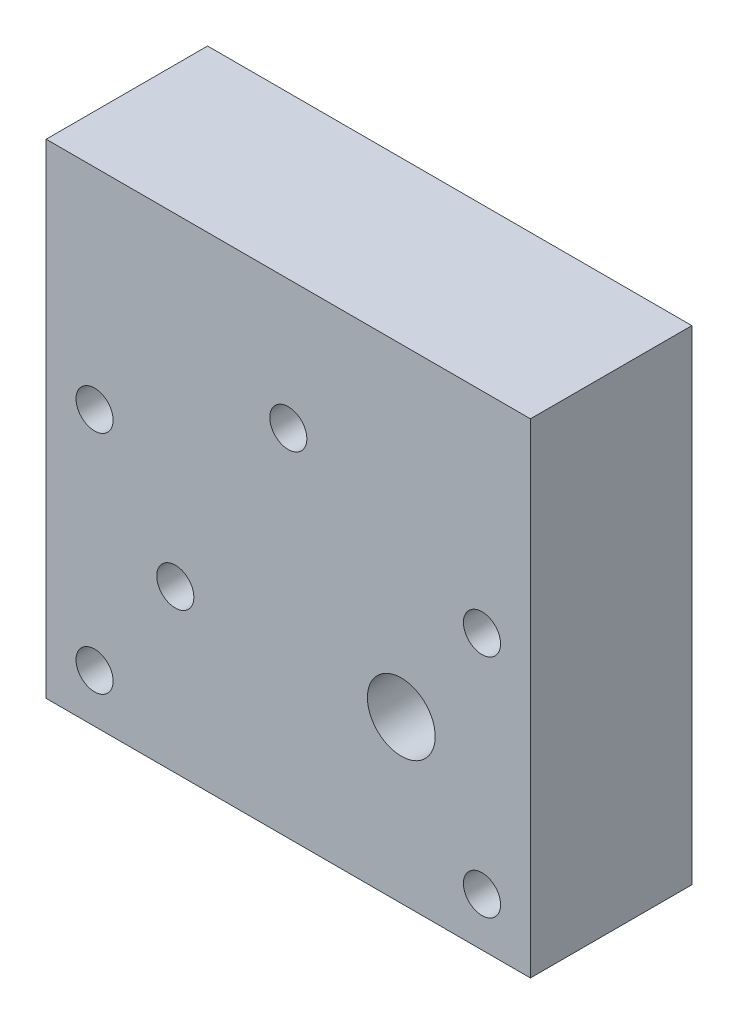
ISO-10303-21;
HEADER;
FILE_DESCRIPTION(('STEP AP214'),'2;1');
FILE_NAME('part.step','',(''),(''),'','','');
FILE_SCHEMA(('AUTOMOTIVE_DESIGN { 1 0 10303 214 1 1 1 1 }'));
ENDSEC;
DATA;
#1=APPLICATION_CONTEXT('core data for automotive mechanical design processes');
#2=APPLICATION_PROTOCOL_DEFINITION('international standard','automotive_design',2000,#1);
#3=PRODUCT_CONTEXT('',#1,'mechanical');
#4=PRODUCT('Part','Part','',(#3));
#5=PRODUCT_RELATED_PRODUCT_CATEGORY('part','',(#4));
#6=PRODUCT_DEFINITION_FORMATION('','',#4);
#7=PRODUCT_DEFINITION_CONTEXT('part definition',#1,'design');
#8=PRODUCT_DEFINITION('design','',#6,#7);
#9=PRODUCT_DEFINITION_SHAPE('','',#8);
#10=(LENGTH_UNIT() NAMED_UNIT(*) SI_UNIT(.MILLI.,.METRE.));
#11=(NAMED_UNIT(*) PLANE_ANGLE_UNIT() SI_UNIT($,.RADIAN.));
#12=(NAMED_UNIT(*) SI_UNIT($,.STERADIAN.) SOLID_ANGLE_UNIT());
#13=UNCERTAINTY_MEASURE_WITH_UNIT(LENGTH_MEASURE(1.E-05),#10,'distance_accuracy_value','');
#14=(GEOMETRIC_REPRESENTATION_CONTEXT(3) GLOBAL_UNCERTAINTY_ASSIGNED_CONTEXT((#13)) GLOBAL_UNIT_ASSIGNED_CONTEXT((#10,
#11,#12)) REPRESENTATION_CONTEXT('',''));
#15=CARTESIAN_POINT('',(0.,0.,0.));
#16=DIRECTION('',(0.,0.,1.));
#17=DIRECTION('',(1.,0.,0.));
#18=AXIS2_PLACEMENT_3D('',#15,#16,#17);
#19=CARTESIAN_POINT('',(0.,0.,10.));
#20=DIRECTION('',(0.,0.,-1.));
#21=DIRECTION('',(-1.,0.,0.));
#22=AXIS2_PLACEMENT_3D('',#19,#20,#21);
#23=PLANE('',#22);
#24=CARTESIAN_POINT('',(15.,22.,10.));
#25=DIRECTION('',(0.,0.,1.));
#26=DIRECTION('',(1.,0.,0.));
#27=AXIS2_PLACEMENT_3D('',#24,#25,#26);
#28=CIRCLE('',#27,1.15);
#29=CARTESIAN_POINT('',(16.15,22.,10.));
#30=VERTEX_POINT('',#29);
#31=EDGE_CURVE('E168',#30,#30,#28,.T.);
#32=ORIENTED_EDGE('',*,*,#31,.F.);
#33=EDGE_LOOP('',(#32));
#34=FACE_BOUND('',#33,.T.);
#35=CARTESIAN_POINT('',(27.,3.,10.));
#36=DIRECTION('',(0.,0.,1.));
#37=DIRECTION('',(1.,0.,0.));
#38=AXIS2_PLACEMENT_3D('',#35,#36,#37);
#39=CIRCLE('',#38,1.15);
#40=CARTESIAN_POINT('',(28.15,3.,10.));
#41=VERTEX_POINT('',#40);
#42=EDGE_CURVE('E153',#41,#41,#39,.T.);
#43=ORIENTED_EDGE('',*,*,#42,.F.);
#44=EDGE_LOOP('',(#43));
#45=FACE_BOUND('',#44,.T.);
#46=CARTESIAN_POINT('',(3.,17.,10.));
#47=DIRECTION('',(0.,0.,1.));
#48=DIRECTION('',(1.,0.,0.));
#49=AXIS2_PLACEMENT_3D('',#46,#47,#48);
#50=CIRCLE('',#49,1.15);
#51=CARTESIAN_POINT('',(4.15,17.,10.));
#52=VERTEX_POINT('',#51);
#53=EDGE_CURVE('E138',#52,#52,#50,.T.);
#54=ORIENTED_EDGE('',*,*,#53,.F.);
#55=EDGE_LOOP('',(#54));
#56=FACE_BOUND('',#55,.T.);
#57=DIRECTION('',(0.,-1.,0.));
#58=VECTOR('',#57,1.);
#59=CARTESIAN_POINT('',(0.,0.,10.));
#60=LINE('',#59,#58);
#61=CARTESIAN_POINT('',(0.,30.,10.));
#62=VERTEX_POINT('',#61);
#63=CARTESIAN_POINT('',(0.,0.,10.));
#64=VERTEX_POINT('',#63);
#65=EDGE_CURVE('E92',#62,#64,#60,.T.);
#66=ORIENTED_EDGE('',*,*,#65,.T.);
#67=DIRECTION('',(1.,0.,0.));
#68=VECTOR('',#67,1.);
#69=CARTESIAN_POINT('',(0.,0.,10.));
#70=LINE('',#69,#68);
#71=CARTESIAN_POINT('',(30.,0.,10.));
#72=VERTEX_POINT('',#71);
#73=EDGE_CURVE('E87',#64,#72,#70,.T.);
#74=ORIENTED_EDGE('',*,*,#73,.T.);
#75=DIRECTION('',(0.,1.,0.));
#76=VECTOR('',#75,1.);
#77=CARTESIAN_POINT('',(30.,0.,10.));
#78=LINE('',#77,#76);
#79=CARTESIAN_POINT('',(30.,30.,10.));
#80=VERTEX_POINT('',#79);
#81=EDGE_CURVE('E90',#72,#80,#78,.T.);
#82=ORIENTED_EDGE('',*,*,#81,.T.);
#83=DIRECTION('',(-1.,0.,0.));
#84=VECTOR('',#83,1.);
#85=CARTESIAN_POINT('',(0.,30.,10.));
#86=LINE('',#85,#84);
#87=EDGE_CURVE('E57',#80,#62,#86,.T.);
#88=ORIENTED_EDGE('',*,*,#87,.T.);
#89=EDGE_LOOP('',(#66,#74,#82,#88));
#90=FACE_BOUND('',#89,.T.);
#91=CARTESIAN_POINT('',(3.,3.,10.));
#92=DIRECTION('',(0.,0.,1.));
#93=DIRECTION('',(1.,0.,0.));
#94=AXIS2_PLACEMENT_3D('',#91,#92,#93);
#95=CIRCLE('',#94,1.15);
#96=CARTESIAN_POINT('',(4.15,3.,10.));
#97=VERTEX_POINT('',#96);
#98=EDGE_CURVE('E114',#97,#97,#95,.T.);
#99=ORIENTED_EDGE('',*,*,#98,.F.);
#100=EDGE_LOOP('',(#99));
#101=FACE_BOUND('',#100,.T.);
#102=CARTESIAN_POINT('',(27.,17.,10.));
#103=DIRECTION('',(0.,0.,1.));
#104=DIRECTION('',(1.,0.,0.));
#105=AXIS2_PLACEMENT_3D('',#102,#103,#104);
#106=CIRCLE('',#105,1.15);
#107=CARTESIAN_POINT('',(28.15,17.,10.));
#108=VERTEX_POINT('',#107);
#109=EDGE_CURVE('E145',#108,#108,#106,.T.);
#110=ORIENTED_EDGE('',*,*,#109,.F.);
#111=EDGE_LOOP('',(#110));
#112=FACE_BOUND('',#111,.T.);
#113=CARTESIAN_POINT('',(8.,10.,10.));
#114=DIRECTION('',(0.,0.,1.));
#115=DIRECTION('',(1.,0.,0.));
#116=AXIS2_PLACEMENT_3D('',#113,#114,#115);
#117=CIRCLE('',#116,1.15);
#118=CARTESIAN_POINT('',(9.15,10.,10.));
#119=VERTEX_POINT('',#118);
#120=EDGE_CURVE('E161',#119,#119,#117,.T.);
#121=ORIENTED_EDGE('',*,*,#120,.F.);
#122=EDGE_LOOP('',(#121));
#123=FACE_BOUND('',#122,.T.);
#124=CARTESIAN_POINT('',(22.,10.,10.));
#125=DIRECTION('',(0.,0.,1.));
#126=DIRECTION('',(1.,0.,0.));
#127=AXIS2_PLACEMENT_3D('',#124,#125,#126);
#128=CIRCLE('',#127,2.1);
#129=CARTESIAN_POINT('',(24.1,10.,10.));
#130=VERTEX_POINT('',#129);
#131=EDGE_CURVE('E176',#130,#130,#128,.T.);
#132=ORIENTED_EDGE('',*,*,#131,.F.);
#133=EDGE_LOOP('',(#132));
#134=FACE_BOUND('',#133,.T.);
#135=ADVANCED_FACE('F39',(#34,#45,#56,#90,#101,#112,#123,#134),#23,.F.);
#136=CARTESIAN_POINT('',(0.,0.,0.));
#137=DIRECTION('',(0.,0.,-1.));
#138=DIRECTION('',(-1.,0.,0.));
#139=AXIS2_PLACEMENT_3D('',#136,#137,#138);
#140=PLANE('',#139);
#141=CARTESIAN_POINT('',(15.,22.,0.));
#142=DIRECTION('',(0.,0.,1.));
#143=DIRECTION('',(1.,0.,0.));
#144=AXIS2_PLACEMENT_3D('',#141,#142,#143);
#145=CIRCLE('',#144,1.15);
#146=CARTESIAN_POINT('',(16.15,22.,0.));
#147=VERTEX_POINT('',#146);
#148=EDGE_CURVE('E172',#147,#147,#145,.T.);
#149=ORIENTED_EDGE('',*,*,#148,.T.);
#150=EDGE_LOOP('',(#149));
#151=FACE_BOUND('',#150,.T.);
#152=CARTESIAN_POINT('',(27.,3.,0.));
#153=DIRECTION('',(0.,0.,1.));
#154=DIRECTION('',(1.,0.,0.));
#155=AXIS2_PLACEMENT_3D('',#152,#153,#154);
#156=CIRCLE('',#155,1.15);
#157=CARTESIAN_POINT('',(28.15,3.,0.));
#158=VERTEX_POINT('',#157);
#159=EDGE_CURVE('E157',#158,#158,#156,.T.);
#160=ORIENTED_EDGE('',*,*,#159,.T.);
#161=EDGE_LOOP('',(#160));
#162=FACE_BOUND('',#161,.T.);
#163=CARTESIAN_POINT('',(3.,17.,0.));
#164=DIRECTION('',(0.,0.,1.));
#165=DIRECTION('',(1.,0.,0.));
#166=AXIS2_PLACEMENT_3D('',#163,#164,#165);
#167=CIRCLE('',#166,1.15);
#168=CARTESIAN_POINT('',(4.15,17.,0.));
#169=VERTEX_POINT('',#168);
#170=EDGE_CURVE('E141',#169,#169,#167,.T.);
#171=ORIENTED_EDGE('',*,*,#170,.T.);
#172=EDGE_LOOP('',(#171));
#173=FACE_BOUND('',#172,.T.);
#174=DIRECTION('',(0.,-1.,0.));
#175=VECTOR('',#174,1.);
#176=CARTESIAN_POINT('',(0.,0.,0.));
#177=LINE('',#176,#175);
#178=CARTESIAN_POINT('',(0.,30.,0.));
#179=VERTEX_POINT('',#178);
#180=CARTESIAN_POINT('',(0.,0.,0.));
#181=VERTEX_POINT('',#180);
#182=EDGE_CURVE('E110',#179,#181,#177,.T.);
#183=ORIENTED_EDGE('',*,*,#182,.F.);
#184=DIRECTION('',(-1.,0.,0.));
#185=VECTOR('',#184,1.);
#186=CARTESIAN_POINT('',(0.,30.,0.));
#187=LINE('',#186,#185);
#188=CARTESIAN_POINT('',(30.,30.,0.));
#189=VERTEX_POINT('',#188);
#190=EDGE_CURVE('E80',#189,#179,#187,.T.);
#191=ORIENTED_EDGE('',*,*,#190,.F.);
#192=DIRECTION('',(0.,1.,0.));
#193=VECTOR('',#192,1.);
#194=CARTESIAN_POINT('',(30.,0.,0.));
#195=LINE('',#194,#193);
#196=CARTESIAN_POINT('',(30.,0.,0.));
#197=VERTEX_POINT('',#196);
#198=EDGE_CURVE('E74',#197,#189,#195,.T.);
#199=ORIENTED_EDGE('',*,*,#198,.F.);
#200=DIRECTION('',(1.,0.,0.));
#201=VECTOR('',#200,1.);
#202=CARTESIAN_POINT('',(0.,0.,0.));
#203=LINE('',#202,#201);
#204=EDGE_CURVE('E97',#181,#197,#203,.T.);
#205=ORIENTED_EDGE('',*,*,#204,.F.);
#206=EDGE_LOOP('',(#183,#191,#199,#205));
#207=FACE_BOUND('',#206,.T.);
#208=CARTESIAN_POINT('',(3.,3.,0.));
#209=DIRECTION('',(0.,0.,1.));
#210=DIRECTION('',(1.,0.,0.));
#211=AXIS2_PLACEMENT_3D('',#208,#209,#210);
#212=CIRCLE('',#211,1.15);
#213=CARTESIAN_POINT('',(4.15,3.,0.));
#214=VERTEX_POINT('',#213);
#215=EDGE_CURVE('E135',#214,#214,#212,.T.);
#216=ORIENTED_EDGE('',*,*,#215,.T.);
#217=EDGE_LOOP('',(#216));
#218=FACE_BOUND('',#217,.T.);
#219=CARTESIAN_POINT('',(27.,17.,0.));
#220=DIRECTION('',(0.,0.,1.));
#221=DIRECTION('',(1.,0.,0.));
#222=AXIS2_PLACEMENT_3D('',#219,#220,#221);
#223=CIRCLE('',#222,1.15);
#224=CARTESIAN_POINT('',(28.15,17.,0.));
#225=VERTEX_POINT('',#224);
#226=EDGE_CURVE('E149',#225,#225,#223,.T.);
#227=ORIENTED_EDGE('',*,*,#226,.T.);
#228=EDGE_LOOP('',(#227));
#229=FACE_BOUND('',#228,.T.);
#230=CARTESIAN_POINT('',(8.,10.,0.));
#231=DIRECTION('',(0.,0.,1.));
#232=DIRECTION('',(1.,0.,0.));
#233=AXIS2_PLACEMENT_3D('',#230,#231,#232);
#234=CIRCLE('',#233,1.15);
#235=CARTESIAN_POINT('',(9.15,10.,0.));
#236=VERTEX_POINT('',#235);
#237=EDGE_CURVE('E164',#236,#236,#234,.T.);
#238=ORIENTED_EDGE('',*,*,#237,.T.);
#239=EDGE_LOOP('',(#238));
#240=FACE_BOUND('',#239,.T.);
#241=CARTESIAN_POINT('',(22.,10.,0.));
#242=DIRECTION('',(0.,0.,1.));
#243=DIRECTION('',(1.,0.,0.));
#244=AXIS2_PLACEMENT_3D('',#241,#242,#243);
#245=CIRCLE('',#244,2.1);
#246=CARTESIAN_POINT('',(24.1,10.,0.));
#247=VERTEX_POINT('',#246);
#248=EDGE_CURVE('E180',#247,#247,#245,.T.);
#249=ORIENTED_EDGE('',*,*,#248,.T.);
#250=EDGE_LOOP('',(#249));
#251=FACE_BOUND('',#250,.T.);
#252=ADVANCED_FACE('F128',(#151,#162,#173,#207,#218,#229,#240,#251),#140,.T.);
#253=CARTESIAN_POINT('',(0.,0.,10.));
#254=DIRECTION('',(1.,0.,0.));
#255=DIRECTION('',(0.,0.,-1.));
#256=AXIS2_PLACEMENT_3D('',#253,#254,#255);
#257=PLANE('',#256);
#258=ORIENTED_EDGE('',*,*,#182,.T.);
#259=DIRECTION('',(0.,0.,-1.));
#260=VECTOR('',#259,1.);
#261=CARTESIAN_POINT('',(0.,0.,10.));
#262=LINE('',#261,#260);
#263=EDGE_CURVE('E11',#64,#181,#262,.T.);
#264=ORIENTED_EDGE('',*,*,#263,.F.);
#265=ORIENTED_EDGE('',*,*,#65,.F.);
#266=DIRECTION('',(0.,0.,-1.));
#267=VECTOR('',#266,1.);
#268=CARTESIAN_POINT('',(0.,30.,10.));
#269=LINE('',#268,#267);
#270=EDGE_CURVE('E106',#62,#179,#269,.T.);
#271=ORIENTED_EDGE('',*,*,#270,.T.);
#272=EDGE_LOOP('',(#258,#264,#265,#271));
#273=FACE_BOUND('',#272,.T.);
#274=ADVANCED_FACE('F41',(#273),#257,.F.);
#275=CARTESIAN_POINT('',(0.,0.,10.));
#276=DIRECTION('',(0.,1.,0.));
#277=DIRECTION('',(0.,0.,1.));
#278=AXIS2_PLACEMENT_3D('',#275,#276,#277);
#279=PLANE('',#278);
#280=ORIENTED_EDGE('',*,*,#204,.T.);
#281=DIRECTION('',(0.,0.,-1.));
#282=VECTOR('',#281,1.);
#283=CARTESIAN_POINT('',(30.,0.,10.));
#284=LINE('',#283,#282);
#285=EDGE_CURVE('E49',#72,#197,#284,.T.);
#286=ORIENTED_EDGE('',*,*,#285,.F.);
#287=ORIENTED_EDGE('',*,*,#73,.F.);
#288=ORIENTED_EDGE('',*,*,#263,.T.);
#289=EDGE_LOOP('',(#280,#286,#287,#288));
#290=FACE_BOUND('',#289,.T.);
#291=ADVANCED_FACE('F96',(#290),#279,.F.);
#292=CARTESIAN_POINT('',(30.,0.,10.));
#293=DIRECTION('',(-1.,0.,0.));
#294=DIRECTION('',(0.,0.,1.));
#295=AXIS2_PLACEMENT_3D('',#292,#293,#294);
#296=PLANE('',#295);
#297=ORIENTED_EDGE('',*,*,#198,.T.);
#298=DIRECTION('',(0.,0.,-1.));
#299=VECTOR('',#298,1.);
#300=CARTESIAN_POINT('',(30.,30.,10.));
#301=LINE('',#300,#299);
#302=EDGE_CURVE('E99',#80,#189,#301,.T.);
#303=ORIENTED_EDGE('',*,*,#302,.F.);
#304=ORIENTED_EDGE('',*,*,#81,.F.);
#305=ORIENTED_EDGE('',*,*,#285,.T.);
#306=EDGE_LOOP('',(#297,#303,#304,#305));
#307=FACE_BOUND('',#306,.T.);
#308=ADVANCED_FACE('F100',(#307),#296,.F.);
#309=CARTESIAN_POINT('',(0.,30.,10.));
#310=DIRECTION('',(0.,-1.,0.));
#311=DIRECTION('',(0.,0.,-1.));
#312=AXIS2_PLACEMENT_3D('',#309,#310,#311);
#313=PLANE('',#312);
#314=ORIENTED_EDGE('',*,*,#190,.T.);
#315=ORIENTED_EDGE('',*,*,#270,.F.);
#316=ORIENTED_EDGE('',*,*,#87,.F.);
#317=ORIENTED_EDGE('',*,*,#302,.T.);
#318=EDGE_LOOP('',(#314,#315,#316,#317));
#319=FACE_BOUND('',#318,.T.);
#320=ADVANCED_FACE('F125',(#319),#313,.F.);
#321=CARTESIAN_POINT('',(3.,3.,10.));
#322=DIRECTION('',(0.,0.,-1.));
#323=DIRECTION('',(-1.,0.,0.));
#324=AXIS2_PLACEMENT_3D('',#321,#322,#323);
#325=CYLINDRICAL_SURFACE('',#324,1.15);
#326=ORIENTED_EDGE('',*,*,#98,.T.);
#327=EDGE_LOOP('',(#326));
#328=FACE_BOUND('',#327,.T.);
#329=ORIENTED_EDGE('',*,*,#215,.F.);
#330=EDGE_LOOP('',(#329));
#331=FACE_BOUND('',#330,.T.);
#332=ADVANCED_FACE('F200',(#328,#331),#325,.F.);
#333=CARTESIAN_POINT('',(3.,17.,10.));
#334=DIRECTION('',(0.,0.,-1.));
#335=DIRECTION('',(-1.,0.,0.));
#336=AXIS2_PLACEMENT_3D('',#333,#334,#335);
#337=CYLINDRICAL_SURFACE('',#336,1.15);
#338=ORIENTED_EDGE('',*,*,#53,.T.);
#339=EDGE_LOOP('',(#338));
#340=FACE_BOUND('',#339,.T.);
#341=ORIENTED_EDGE('',*,*,#170,.F.);
#342=EDGE_LOOP('',(#341));
#343=FACE_BOUND('',#342,.T.);
#344=ADVANCED_FACE('F252',(#340,#343),#337,.F.);
#345=CARTESIAN_POINT('',(27.,17.,10.));
#346=DIRECTION('',(0.,0.,-1.));
#347=DIRECTION('',(-1.,0.,0.));
#348=AXIS2_PLACEMENT_3D('',#345,#346,#347);
#349=CYLINDRICAL_SURFACE('',#348,1.15);
#350=ORIENTED_EDGE('',*,*,#109,.T.);
#351=EDGE_LOOP('',(#350));
#352=FACE_BOUND('',#351,.T.);
#353=ORIENTED_EDGE('',*,*,#226,.F.);
#354=EDGE_LOOP('',(#353));
#355=FACE_BOUND('',#354,.T.);
#356=ADVANCED_FACE('F261',(#352,#355),#349,.F.);
#357=CARTESIAN_POINT('',(27.,3.,10.));
#358=DIRECTION('',(0.,0.,-1.));
#359=DIRECTION('',(-1.,0.,0.));
#360=AXIS2_PLACEMENT_3D('',#357,#358,#359);
#361=CYLINDRICAL_SURFACE('',#360,1.15);
#362=ORIENTED_EDGE('',*,*,#42,.T.);
#363=EDGE_LOOP('',(#362));
#364=FACE_BOUND('',#363,.T.);
#365=ORIENTED_EDGE('',*,*,#159,.F.);
#366=EDGE_LOOP('',(#365));
#367=FACE_BOUND('',#366,.T.);
#368=ADVANCED_FACE('F270',(#364,#367),#361,.F.);
#369=CARTESIAN_POINT('',(8.,10.,10.));
#370=DIRECTION('',(0.,0.,-1.));
#371=DIRECTION('',(-1.,0.,0.));
#372=AXIS2_PLACEMENT_3D('',#369,#370,#371);
#373=CYLINDRICAL_SURFACE('',#372,1.15);
#374=ORIENTED_EDGE('',*,*,#120,.T.);
#375=EDGE_LOOP('',(#374));
#376=FACE_BOUND('',#375,.T.);
#377=ORIENTED_EDGE('',*,*,#237,.F.);
#378=EDGE_LOOP('',(#377));
#379=FACE_BOUND('',#378,.T.);
#380=ADVANCED_FACE('F280',(#376,#379),#373,.F.);
#381=CARTESIAN_POINT('',(15.,22.,10.));
#382=DIRECTION('',(0.,0.,-1.));
#383=DIRECTION('',(-1.,0.,0.));
#384=AXIS2_PLACEMENT_3D('',#381,#382,#383);
#385=CYLINDRICAL_SURFACE('',#384,1.15);
#386=ORIENTED_EDGE('',*,*,#31,.T.);
#387=EDGE_LOOP('',(#386));
#388=FACE_BOUND('',#387,.T.);
#389=ORIENTED_EDGE('',*,*,#148,.F.);
#390=EDGE_LOOP('',(#389));
#391=FACE_BOUND('',#390,.T.);
#392=ADVANCED_FACE('F290',(#388,#391),#385,.F.);
#393=CARTESIAN_POINT('',(22.,10.,10.));
#394=DIRECTION('',(0.,0.,-1.));
#395=DIRECTION('',(-1.,0.,0.));
#396=AXIS2_PLACEMENT_3D('',#393,#394,#395);
#397=CYLINDRICAL_SURFACE('',#396,2.1);
#398=ORIENTED_EDGE('',*,*,#131,.T.);
#399=EDGE_LOOP('',(#398));
#400=FACE_BOUND('',#399,.T.);
#401=ORIENTED_EDGE('',*,*,#248,.F.);
#402=EDGE_LOOP('',(#401));
#403=FACE_BOUND('',#402,.T.);
#404=ADVANCED_FACE('F186',(#400,#403),#397,.F.);
#405=CLOSED_SHELL('',(#135,#252,#274,#291,#308,#320,#332,#344,#356,#368,#380,#392,#404));
#406=MANIFOLD_SOLID_BREP('B2',#405);
#407=ADVANCED_BREP_SHAPE_REPRESENTATION('',(#18,#406),#14);
#408=SHAPE_DEFINITION_REPRESENTATION(#9,#407);
ENDSEC;
END-ISO-10303-21;
